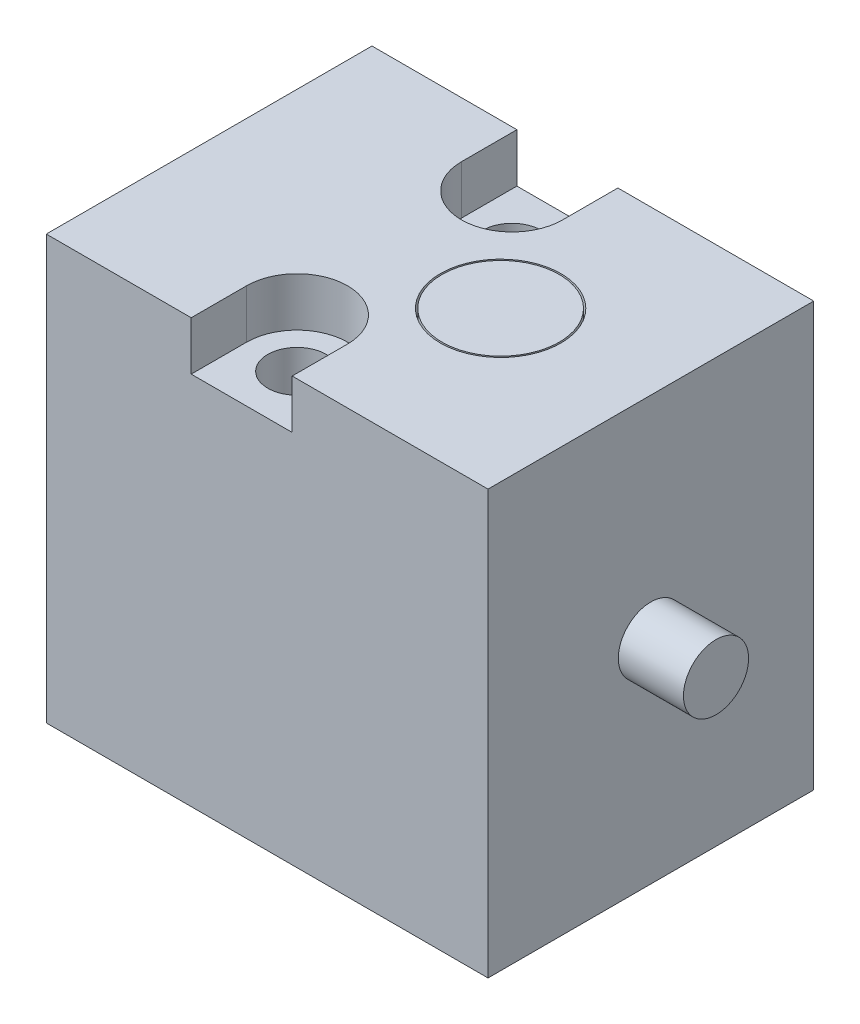
ISO-10303-21;
HEADER;
FILE_DESCRIPTION(('STEP AP214'),'2;1');
FILE_NAME('part.step','',(''),(''),'','','');
FILE_SCHEMA(('AUTOMOTIVE_DESIGN { 1 0 10303 214 1 1 1 1 }'));
ENDSEC;
DATA;
#1=APPLICATION_CONTEXT('core data for automotive mechanical design processes');
#2=APPLICATION_PROTOCOL_DEFINITION('international standard','automotive_design',2000,#1);
#3=PRODUCT_CONTEXT('',#1,'mechanical');
#4=PRODUCT('Part','Part','',(#3));
#5=PRODUCT_RELATED_PRODUCT_CATEGORY('part','',(#4));
#6=PRODUCT_DEFINITION_FORMATION('','',#4);
#7=PRODUCT_DEFINITION_CONTEXT('part definition',#1,'design');
#8=PRODUCT_DEFINITION('design','',#6,#7);
#9=PRODUCT_DEFINITION_SHAPE('','',#8);
#10=(LENGTH_UNIT() NAMED_UNIT(*) SI_UNIT(.MILLI.,.METRE.));
#11=(NAMED_UNIT(*) PLANE_ANGLE_UNIT() SI_UNIT($,.RADIAN.));
#12=(NAMED_UNIT(*) SI_UNIT($,.STERADIAN.) SOLID_ANGLE_UNIT());
#13=UNCERTAINTY_MEASURE_WITH_UNIT(LENGTH_MEASURE(1.E-05),#10,'distance_accuracy_value','');
#14=(GEOMETRIC_REPRESENTATION_CONTEXT(3) GLOBAL_UNCERTAINTY_ASSIGNED_CONTEXT((#13)) GLOBAL_UNIT_ASSIGNED_CONTEXT((#10,
#11,#12)) REPRESENTATION_CONTEXT('',''));
#15=CARTESIAN_POINT('',(0.,0.,0.));
#16=DIRECTION('',(0.,0.,1.));
#17=DIRECTION('',(1.,0.,0.));
#18=AXIS2_PLACEMENT_3D('',#15,#16,#17);
#19=CARTESIAN_POINT('',(6.7815,6.5,5.));
#20=DIRECTION('',(0.,0.,1.));
#21=DIRECTION('',(1.,0.,0.));
#22=AXIS2_PLACEMENT_3D('',#19,#20,#21);
#23=PLANE('',#22);
#24=DIRECTION('',(0.,-1.,0.));
#25=VECTOR('',#24,1.);
#26=CARTESIAN_POINT('',(4.45,6.5,5.));
#27=LINE('',#26,#25);
#28=CARTESIAN_POINT('',(4.45,13.,5.));
#29=VERTEX_POINT('',#28);
#30=CARTESIAN_POINT('',(4.45,11.5,5.));
#31=VERTEX_POINT('',#30);
#32=EDGE_CURVE('E130',#29,#31,#27,.T.);
#33=ORIENTED_EDGE('',*,*,#32,.F.);
#34=DIRECTION('',(1.,0.,0.));
#35=VECTOR('',#34,1.);
#36=CARTESIAN_POINT('',(6.7815,13.,5.));
#37=LINE('',#36,#35);
#38=CARTESIAN_POINT('',(0.,13.,5.));
#39=VERTEX_POINT('',#38);
#40=EDGE_CURVE('E206',#39,#29,#37,.T.);
#41=ORIENTED_EDGE('',*,*,#40,.F.);
#42=DIRECTION('',(0.,1.,0.));
#43=VECTOR('',#42,1.);
#44=CARTESIAN_POINT('',(0.,6.5,5.));
#45=LINE('',#44,#43);
#46=CARTESIAN_POINT('',(0.,0.,5.));
#47=VERTEX_POINT('',#46);
#48=EDGE_CURVE('E210',#47,#39,#45,.T.);
#49=ORIENTED_EDGE('',*,*,#48,.F.);
#50=DIRECTION('',(-1.,0.,0.));
#51=VECTOR('',#50,1.);
#52=CARTESIAN_POINT('',(6.7815,0.,5.));
#53=LINE('',#52,#51);
#54=CARTESIAN_POINT('',(13.563,0.,5.));
#55=VERTEX_POINT('',#54);
#56=EDGE_CURVE('E213',#55,#47,#53,.T.);
#57=ORIENTED_EDGE('',*,*,#56,.F.);
#58=DIRECTION('',(0.,-1.,0.));
#59=VECTOR('',#58,1.);
#60=CARTESIAN_POINT('',(13.563,6.5,5.));
#61=LINE('',#60,#59);
#62=CARTESIAN_POINT('',(13.563,13.,5.));
#63=VERTEX_POINT('',#62);
#64=EDGE_CURVE('E201',#63,#55,#61,.T.);
#65=ORIENTED_EDGE('',*,*,#64,.F.);
#66=CARTESIAN_POINT('',(7.55,13.,5.));
#67=VERTEX_POINT('',#66);
#68=EDGE_CURVE('E205',#67,#63,#37,.T.);
#69=ORIENTED_EDGE('',*,*,#68,.F.);
#70=DIRECTION('',(0.,1.,0.));
#71=VECTOR('',#70,1.);
#72=CARTESIAN_POINT('',(7.55,6.5,5.));
#73=LINE('',#72,#71);
#74=CARTESIAN_POINT('',(7.55,11.5,5.));
#75=VERTEX_POINT('',#74);
#76=EDGE_CURVE('E31',#75,#67,#73,.T.);
#77=ORIENTED_EDGE('',*,*,#76,.F.);
#78=DIRECTION('',(1.,0.,0.));
#79=VECTOR('',#78,1.);
#80=CARTESIAN_POINT('',(6.7815,11.5,5.));
#81=LINE('',#80,#79);
#82=EDGE_CURVE('E24',#31,#75,#81,.T.);
#83=ORIENTED_EDGE('',*,*,#82,.F.);
#84=EDGE_LOOP('',(#33,#41,#49,#57,#65,#69,#77,#83));
#85=FACE_BOUND('',#84,.T.);
#86=ADVANCED_FACE('F16',(#85),#23,.T.);
#87=CARTESIAN_POINT('',(6.7815,0.,-5.));
#88=DIRECTION('',(0.,-1.,0.));
#89=DIRECTION('',(0.,0.,-1.));
#90=AXIS2_PLACEMENT_3D('',#87,#88,#89);
#91=PLANE('',#90);
#92=CARTESIAN_POINT('',(9.4,0.,0.));
#93=DIRECTION('',(0.,-1.,0.));
#94=DIRECTION('',(0.,0.,-1.));
#95=AXIS2_PLACEMENT_3D('',#92,#93,#94);
#96=CIRCLE('',#95,0.6);
#97=CARTESIAN_POINT('',(9.4,0.,-0.6));
#98=VERTEX_POINT('',#97);
#99=EDGE_CURVE('E258',#98,#98,#96,.T.);
#100=ORIENTED_EDGE('',*,*,#99,.F.);
#101=EDGE_LOOP('',(#100));
#102=FACE_BOUND('',#101,.T.);
#103=CARTESIAN_POINT('',(4.,0.,0.));
#104=DIRECTION('',(0.,-1.,0.));
#105=DIRECTION('',(0.,0.,-1.));
#106=AXIS2_PLACEMENT_3D('',#103,#104,#105);
#107=CIRCLE('',#106,0.6);
#108=CARTESIAN_POINT('',(4.,0.,-0.6));
#109=VERTEX_POINT('',#108);
#110=EDGE_CURVE('E253',#109,#109,#107,.T.);
#111=ORIENTED_EDGE('',*,*,#110,.F.);
#112=EDGE_LOOP('',(#111));
#113=FACE_BOUND('',#112,.T.);
#114=CARTESIAN_POINT('',(6.,0.,3.3));
#115=DIRECTION('',(0.,-1.,0.));
#116=DIRECTION('',(0.,0.,-1.));
#117=AXIS2_PLACEMENT_3D('',#114,#115,#116);
#118=CIRCLE('',#117,0.9);
#119=CARTESIAN_POINT('',(6.,0.,2.4));
#120=VERTEX_POINT('',#119);
#121=EDGE_CURVE('E243',#120,#120,#118,.T.);
#122=ORIENTED_EDGE('',*,*,#121,.F.);
#123=EDGE_LOOP('',(#122));
#124=FACE_BOUND('',#123,.T.);
#125=CARTESIAN_POINT('',(6.,0.,-3.3));
#126=DIRECTION('',(0.,-1.,0.));
#127=DIRECTION('',(0.,0.,-1.));
#128=AXIS2_PLACEMENT_3D('',#125,#126,#127);
#129=CIRCLE('',#128,0.9);
#130=CARTESIAN_POINT('',(6.,0.,-4.2));
#131=VERTEX_POINT('',#130);
#132=EDGE_CURVE('E242',#131,#131,#129,.T.);
#133=ORIENTED_EDGE('',*,*,#132,.F.);
#134=EDGE_LOOP('',(#133));
#135=FACE_BOUND('',#134,.T.);
#136=DIRECTION('',(0.,0.,1.));
#137=VECTOR('',#136,1.);
#138=CARTESIAN_POINT('',(13.563,0.,-5.));
#139=LINE('',#138,#137);
#140=CARTESIAN_POINT('',(13.563,0.,-5.));
#141=VERTEX_POINT('',#140);
#142=EDGE_CURVE('E177',#141,#55,#139,.T.);
#143=ORIENTED_EDGE('',*,*,#142,.T.);
#144=ORIENTED_EDGE('',*,*,#56,.T.);
#145=DIRECTION('',(0.,0.,1.));
#146=VECTOR('',#145,1.);
#147=CARTESIAN_POINT('',(0.,0.,-5.));
#148=LINE('',#147,#146);
#149=CARTESIAN_POINT('',(0.,0.,-5.));
#150=VERTEX_POINT('',#149);
#151=EDGE_CURVE('E197',#150,#47,#148,.T.);
#152=ORIENTED_EDGE('',*,*,#151,.F.);
#153=DIRECTION('',(1.,0.,0.));
#154=VECTOR('',#153,1.);
#155=CARTESIAN_POINT('',(6.7815,0.,-5.));
#156=LINE('',#155,#154);
#157=EDGE_CURVE('E168',#150,#141,#156,.T.);
#158=ORIENTED_EDGE('',*,*,#157,.T.);
#159=EDGE_LOOP('',(#143,#144,#152,#158));
#160=FACE_BOUND('',#159,.T.);
#161=ADVANCED_FACE('F319',(#102,#113,#124,#135,#160),#91,.T.);
#162=CARTESIAN_POINT('',(0.,6.5,-5.));
#163=DIRECTION('',(-1.,0.,0.));
#164=DIRECTION('',(0.,0.,1.));
#165=AXIS2_PLACEMENT_3D('',#162,#163,#164);
#166=PLANE('',#165);
#167=CARTESIAN_POINT('',(0.,6.5,0.));
#168=DIRECTION('',(-1.,0.,0.));
#169=DIRECTION('',(0.,0.,1.));
#170=AXIS2_PLACEMENT_3D('',#167,#168,#169);
#171=CIRCLE('',#170,3.4);
#172=CARTESIAN_POINT('',(0.,6.5,3.4));
#173=VERTEX_POINT('',#172);
#174=EDGE_CURVE('E248',#173,#173,#171,.T.);
#175=ORIENTED_EDGE('',*,*,#174,.F.);
#176=EDGE_LOOP('',(#175));
#177=FACE_BOUND('',#176,.T.);
#178=ORIENTED_EDGE('',*,*,#151,.T.);
#179=ORIENTED_EDGE('',*,*,#48,.T.);
#180=DIRECTION('',(0.,0.,1.));
#181=VECTOR('',#180,1.);
#182=CARTESIAN_POINT('',(0.,13.,-5.));
#183=LINE('',#182,#181);
#184=CARTESIAN_POINT('',(0.,13.,-5.));
#185=VERTEX_POINT('',#184);
#186=EDGE_CURVE('E193',#185,#39,#183,.T.);
#187=ORIENTED_EDGE('',*,*,#186,.F.);
#188=DIRECTION('',(0.,-1.,0.));
#189=VECTOR('',#188,1.);
#190=CARTESIAN_POINT('',(0.,6.5,-5.));
#191=LINE('',#190,#189);
#192=EDGE_CURVE('E172',#185,#150,#191,.T.);
#193=ORIENTED_EDGE('',*,*,#192,.T.);
#194=EDGE_LOOP('',(#178,#179,#187,#193));
#195=FACE_BOUND('',#194,.T.);
#196=ADVANCED_FACE('F323',(#177,#195),#166,.T.);
#197=CARTESIAN_POINT('',(6.7815,13.,-5.));
#198=DIRECTION('',(0.,1.,0.));
#199=DIRECTION('',(0.,0.,1.));
#200=AXIS2_PLACEMENT_3D('',#197,#198,#199);
#201=PLANE('',#200);
#202=CARTESIAN_POINT('',(8.95,13.,0.));
#203=DIRECTION('',(0.,1.,0.));
#204=DIRECTION('',(0.,0.,1.));
#205=AXIS2_PLACEMENT_3D('',#202,#203,#204);
#206=CIRCLE('',#205,1.85);
#207=CARTESIAN_POINT('',(8.95,13.,1.85));
#208=VERTEX_POINT('',#207);
#209=EDGE_CURVE('E262',#208,#208,#206,.T.);
#210=ORIENTED_EDGE('',*,*,#209,.F.);
#211=EDGE_LOOP('',(#210));
#212=FACE_BOUND('',#211,.T.);
#213=DIRECTION('',(0.,0.,1.));
#214=VECTOR('',#213,1.);
#215=CARTESIAN_POINT('',(4.45,13.,-5.));
#216=LINE('',#215,#214);
#217=CARTESIAN_POINT('',(4.45,13.,3.3));
#218=VERTEX_POINT('',#217);
#219=EDGE_CURVE('E233',#218,#29,#216,.T.);
#220=ORIENTED_EDGE('',*,*,#219,.F.);
#221=CARTESIAN_POINT('',(6.,13.,3.3));
#222=DIRECTION('',(0.,1.,0.));
#223=DIRECTION('',(0.,0.,1.));
#224=AXIS2_PLACEMENT_3D('',#221,#222,#223);
#225=CIRCLE('',#224,1.55);
#226=CARTESIAN_POINT('',(7.55,13.,3.3));
#227=VERTEX_POINT('',#226);
#228=EDGE_CURVE('E114',#227,#218,#225,.T.);
#229=ORIENTED_EDGE('',*,*,#228,.F.);
#230=DIRECTION('',(0.,0.,-1.));
#231=VECTOR('',#230,1.);
#232=CARTESIAN_POINT('',(7.55,13.,-5.));
#233=LINE('',#232,#231);
#234=EDGE_CURVE('E228',#67,#227,#233,.T.);
#235=ORIENTED_EDGE('',*,*,#234,.F.);
#236=ORIENTED_EDGE('',*,*,#68,.T.);
#237=DIRECTION('',(0.,0.,1.));
#238=VECTOR('',#237,1.);
#239=CARTESIAN_POINT('',(13.563,13.,-5.));
#240=LINE('',#239,#238);
#241=CARTESIAN_POINT('',(13.563,13.,-5.));
#242=VERTEX_POINT('',#241);
#243=EDGE_CURVE('E189',#242,#63,#240,.T.);
#244=ORIENTED_EDGE('',*,*,#243,.F.);
#245=DIRECTION('',(-1.,0.,0.));
#246=VECTOR('',#245,1.);
#247=CARTESIAN_POINT('',(6.7815,13.,-5.));
#248=LINE('',#247,#246);
#249=CARTESIAN_POINT('',(7.55,13.,-5.));
#250=VERTEX_POINT('',#249);
#251=EDGE_CURVE('E178',#242,#250,#248,.T.);
#252=ORIENTED_EDGE('',*,*,#251,.T.);
#253=DIRECTION('',(0.,0.,-1.));
#254=VECTOR('',#253,1.);
#255=CARTESIAN_POINT('',(7.55,13.,-5.));
#256=LINE('',#255,#254);
#257=CARTESIAN_POINT('',(7.55,13.,-3.3));
#258=VERTEX_POINT('',#257);
#259=EDGE_CURVE('E39',#258,#250,#256,.T.);
#260=ORIENTED_EDGE('',*,*,#259,.F.);
#261=CARTESIAN_POINT('',(6.,13.,-3.3));
#262=DIRECTION('',(0.,1.,0.));
#263=DIRECTION('',(0.,0.,1.));
#264=AXIS2_PLACEMENT_3D('',#261,#262,#263);
#265=CIRCLE('',#264,1.55);
#266=CARTESIAN_POINT('',(4.45,13.,-3.3));
#267=VERTEX_POINT('',#266);
#268=EDGE_CURVE('E225',#267,#258,#265,.T.);
#269=ORIENTED_EDGE('',*,*,#268,.F.);
#270=DIRECTION('',(0.,0.,1.));
#271=VECTOR('',#270,1.);
#272=CARTESIAN_POINT('',(4.45,13.,-5.));
#273=LINE('',#272,#271);
#274=CARTESIAN_POINT('',(4.45,13.,-5.));
#275=VERTEX_POINT('',#274);
#276=EDGE_CURVE('E165',#275,#267,#273,.T.);
#277=ORIENTED_EDGE('',*,*,#276,.F.);
#278=EDGE_CURVE('E182',#275,#185,#248,.T.);
#279=ORIENTED_EDGE('',*,*,#278,.T.);
#280=ORIENTED_EDGE('',*,*,#186,.T.);
#281=ORIENTED_EDGE('',*,*,#40,.T.);
#282=EDGE_LOOP('',(#220,#229,#235,#236,#244,#252,#260,#269,#277,#279,#280,#281));
#283=FACE_BOUND('',#282,.T.);
#284=ADVANCED_FACE('F300',(#212,#283),#201,.T.);
#285=CARTESIAN_POINT('',(6.7815,6.5,-5.));
#286=DIRECTION('',(0.,0.,-1.));
#287=DIRECTION('',(-1.,0.,0.));
#288=AXIS2_PLACEMENT_3D('',#285,#286,#287);
#289=PLANE('',#288);
#290=DIRECTION('',(0.,1.,0.));
#291=VECTOR('',#290,1.);
#292=CARTESIAN_POINT('',(4.45,6.5,-5.));
#293=LINE('',#292,#291);
#294=CARTESIAN_POINT('',(4.45,11.5,-5.));
#295=VERTEX_POINT('',#294);
#296=EDGE_CURVE('E222',#295,#275,#293,.T.);
#297=ORIENTED_EDGE('',*,*,#296,.F.);
#298=DIRECTION('',(-1.,0.,0.));
#299=VECTOR('',#298,1.);
#300=CARTESIAN_POINT('',(6.7815,11.5,-5.));
#301=LINE('',#300,#299);
#302=CARTESIAN_POINT('',(7.55,11.5,-5.));
#303=VERTEX_POINT('',#302);
#304=EDGE_CURVE('E219',#303,#295,#301,.T.);
#305=ORIENTED_EDGE('',*,*,#304,.F.);
#306=DIRECTION('',(0.,-1.,0.));
#307=VECTOR('',#306,1.);
#308=CARTESIAN_POINT('',(7.55,6.5,-5.));
#309=LINE('',#308,#307);
#310=EDGE_CURVE('E216',#250,#303,#309,.T.);
#311=ORIENTED_EDGE('',*,*,#310,.F.);
#312=ORIENTED_EDGE('',*,*,#251,.F.);
#313=DIRECTION('',(0.,1.,0.));
#314=VECTOR('',#313,1.);
#315=CARTESIAN_POINT('',(13.563,6.5,-5.));
#316=LINE('',#315,#314);
#317=EDGE_CURVE('E173',#141,#242,#316,.T.);
#318=ORIENTED_EDGE('',*,*,#317,.F.);
#319=ORIENTED_EDGE('',*,*,#157,.F.);
#320=ORIENTED_EDGE('',*,*,#192,.F.);
#321=ORIENTED_EDGE('',*,*,#278,.F.);
#322=EDGE_LOOP('',(#297,#305,#311,#312,#318,#319,#320,#321));
#323=FACE_BOUND('',#322,.T.);
#324=ADVANCED_FACE('F335',(#323),#289,.T.);
#325=CARTESIAN_POINT('',(13.563,6.5,-5.));
#326=DIRECTION('',(1.,0.,0.));
#327=DIRECTION('',(0.,0.,-1.));
#328=AXIS2_PLACEMENT_3D('',#325,#326,#327);
#329=PLANE('',#328);
#330=CARTESIAN_POINT('',(13.563,6.5,0.));
#331=DIRECTION('',(1.,0.,0.));
#332=DIRECTION('',(0.,0.,-1.));
#333=AXIS2_PLACEMENT_3D('',#330,#331,#332);
#334=CIRCLE('',#333,1.);
#335=CARTESIAN_POINT('',(13.563,6.5,-1.));
#336=VERTEX_POINT('',#335);
#337=EDGE_CURVE('E11',#336,#336,#334,.T.);
#338=ORIENTED_EDGE('',*,*,#337,.F.);
#339=EDGE_LOOP('',(#338));
#340=FACE_BOUND('',#339,.T.);
#341=ORIENTED_EDGE('',*,*,#317,.T.);
#342=ORIENTED_EDGE('',*,*,#243,.T.);
#343=ORIENTED_EDGE('',*,*,#64,.T.);
#344=ORIENTED_EDGE('',*,*,#142,.F.);
#345=EDGE_LOOP('',(#341,#342,#343,#344));
#346=FACE_BOUND('',#345,.T.);
#347=ADVANCED_FACE('F337',(#340,#346),#329,.T.);
#348=CARTESIAN_POINT('',(6.,11.5,-3.3));
#349=DIRECTION('',(0.,-1.,0.));
#350=DIRECTION('',(0.,0.,-1.));
#351=AXIS2_PLACEMENT_3D('',#348,#349,#350);
#352=PLANE('',#351);
#353=CARTESIAN_POINT('',(6.,11.5,-3.3));
#354=DIRECTION('',(0.,-1.,0.));
#355=DIRECTION('',(0.,0.,-1.));
#356=AXIS2_PLACEMENT_3D('',#353,#354,#355);
#357=CIRCLE('',#356,0.9);
#358=CARTESIAN_POINT('',(6.,11.5,-4.2));
#359=VERTEX_POINT('',#358);
#360=EDGE_CURVE('E238',#359,#359,#357,.T.);
#361=ORIENTED_EDGE('',*,*,#360,.T.);
#362=EDGE_LOOP('',(#361));
#363=FACE_BOUND('',#362,.T.);
#364=ORIENTED_EDGE('',*,*,#304,.T.);
#365=DIRECTION('',(0.,0.,-1.));
#366=VECTOR('',#365,1.);
#367=CARTESIAN_POINT('',(4.45,11.5,-3.3));
#368=LINE('',#367,#366);
#369=CARTESIAN_POINT('',(4.45,11.5,-3.3));
#370=VERTEX_POINT('',#369);
#371=EDGE_CURVE('E152',#370,#295,#368,.T.);
#372=ORIENTED_EDGE('',*,*,#371,.F.);
#373=CARTESIAN_POINT('',(6.,11.5,-3.3));
#374=DIRECTION('',(0.,1.,0.));
#375=DIRECTION('',(-1.,0.,0.));
#376=AXIS2_PLACEMENT_3D('',#373,#374,#375);
#377=CIRCLE('',#376,1.55);
#378=CARTESIAN_POINT('',(7.55,11.5,-3.3));
#379=VERTEX_POINT('',#378);
#380=EDGE_CURVE('E156',#370,#379,#377,.T.);
#381=ORIENTED_EDGE('',*,*,#380,.T.);
#382=DIRECTION('',(0.,0.,-1.));
#383=VECTOR('',#382,1.);
#384=CARTESIAN_POINT('',(7.55,11.5,-3.3));
#385=LINE('',#384,#383);
#386=EDGE_CURVE('E148',#379,#303,#385,.T.);
#387=ORIENTED_EDGE('',*,*,#386,.T.);
#388=EDGE_LOOP('',(#364,#372,#381,#387));
#389=FACE_BOUND('',#388,.T.);
#390=ADVANCED_FACE('F340',(#363,#389),#352,.F.);
#391=CARTESIAN_POINT('',(6.,14.,-3.3));
#392=DIRECTION('',(0.,-1.,0.));
#393=DIRECTION('',(-1.,0.,0.));
#394=AXIS2_PLACEMENT_3D('',#391,#392,#393);
#395=CYLINDRICAL_SURFACE('',#394,1.55);
#396=ORIENTED_EDGE('',*,*,#268,.T.);
#397=DIRECTION('',(0.,-1.,0.));
#398=VECTOR('',#397,1.);
#399=CARTESIAN_POINT('',(7.55,14.,-3.3));
#400=LINE('',#399,#398);
#401=EDGE_CURVE('E160',#379,#258,#400,.F.);
#402=ORIENTED_EDGE('',*,*,#401,.F.);
#403=ORIENTED_EDGE('',*,*,#380,.F.);
#404=DIRECTION('',(0.,1.,0.));
#405=VECTOR('',#404,1.);
#406=CARTESIAN_POINT('',(4.45,14.,-3.3));
#407=LINE('',#406,#405);
#408=EDGE_CURVE('E144',#370,#267,#407,.T.);
#409=ORIENTED_EDGE('',*,*,#408,.T.);
#410=EDGE_LOOP('',(#396,#402,#403,#409));
#411=FACE_BOUND('',#410,.T.);
#412=ADVANCED_FACE('F345',(#411),#395,.F.);
#413=CARTESIAN_POINT('',(4.45,14.,-3.3));
#414=DIRECTION('',(-1.,0.,0.));
#415=DIRECTION('',(0.,0.,1.));
#416=AXIS2_PLACEMENT_3D('',#413,#414,#415);
#417=PLANE('',#416);
#418=ORIENTED_EDGE('',*,*,#276,.T.);
#419=ORIENTED_EDGE('',*,*,#408,.F.);
#420=ORIENTED_EDGE('',*,*,#371,.T.);
#421=ORIENTED_EDGE('',*,*,#296,.T.);
#422=EDGE_LOOP('',(#418,#419,#420,#421));
#423=FACE_BOUND('',#422,.T.);
#424=ADVANCED_FACE('F348',(#423),#417,.F.);
#425=CARTESIAN_POINT('',(7.55,14.,-3.3));
#426=DIRECTION('',(1.,0.,0.));
#427=DIRECTION('',(0.,0.,-1.));
#428=AXIS2_PLACEMENT_3D('',#425,#426,#427);
#429=PLANE('',#428);
#430=ORIENTED_EDGE('',*,*,#259,.T.);
#431=ORIENTED_EDGE('',*,*,#310,.T.);
#432=ORIENTED_EDGE('',*,*,#386,.F.);
#433=ORIENTED_EDGE('',*,*,#401,.T.);
#434=EDGE_LOOP('',(#430,#431,#432,#433));
#435=FACE_BOUND('',#434,.T.);
#436=ADVANCED_FACE('F355',(#435),#429,.F.);
#437=CARTESIAN_POINT('',(6.,11.5,3.3));
#438=DIRECTION('',(0.,-1.,0.));
#439=DIRECTION('',(0.,0.,-1.));
#440=AXIS2_PLACEMENT_3D('',#437,#438,#439);
#441=PLANE('',#440);
#442=CARTESIAN_POINT('',(6.,11.5,3.3));
#443=DIRECTION('',(0.,-1.,0.));
#444=DIRECTION('',(0.,0.,-1.));
#445=AXIS2_PLACEMENT_3D('',#442,#443,#444);
#446=CIRCLE('',#445,0.9);
#447=CARTESIAN_POINT('',(6.,11.5,2.4));
#448=VERTEX_POINT('',#447);
#449=EDGE_CURVE('E244',#448,#448,#446,.T.);
#450=ORIENTED_EDGE('',*,*,#449,.T.);
#451=EDGE_LOOP('',(#450));
#452=FACE_BOUND('',#451,.T.);
#453=ORIENTED_EDGE('',*,*,#82,.T.);
#454=DIRECTION('',(0.,0.,1.));
#455=VECTOR('',#454,1.);
#456=CARTESIAN_POINT('',(7.55,11.5,3.3));
#457=LINE('',#456,#455);
#458=CARTESIAN_POINT('',(7.55,11.5,3.3));
#459=VERTEX_POINT('',#458);
#460=EDGE_CURVE('E125',#459,#75,#457,.T.);
#461=ORIENTED_EDGE('',*,*,#460,.F.);
#462=CARTESIAN_POINT('',(6.,11.5,3.3));
#463=DIRECTION('',(0.,1.,0.));
#464=DIRECTION('',(-1.,0.,0.));
#465=AXIS2_PLACEMENT_3D('',#462,#463,#464);
#466=CIRCLE('',#465,1.55);
#467=CARTESIAN_POINT('',(4.45,11.5,3.3));
#468=VERTEX_POINT('',#467);
#469=EDGE_CURVE('E111',#459,#468,#466,.T.);
#470=ORIENTED_EDGE('',*,*,#469,.T.);
#471=DIRECTION('',(0.,0.,1.));
#472=VECTOR('',#471,1.);
#473=CARTESIAN_POINT('',(4.45,11.5,3.3));
#474=LINE('',#473,#472);
#475=EDGE_CURVE('E123',#468,#31,#474,.T.);
#476=ORIENTED_EDGE('',*,*,#475,.T.);
#477=EDGE_LOOP('',(#453,#461,#470,#476));
#478=FACE_BOUND('',#477,.T.);
#479=ADVANCED_FACE('F122',(#452,#478),#441,.F.);
#480=CARTESIAN_POINT('',(6.,14.,3.3));
#481=DIRECTION('',(0.,-1.,0.));
#482=DIRECTION('',(-1.,0.,0.));
#483=AXIS2_PLACEMENT_3D('',#480,#481,#482);
#484=CYLINDRICAL_SURFACE('',#483,1.55);
#485=ORIENTED_EDGE('',*,*,#228,.T.);
#486=DIRECTION('',(0.,-1.,0.));
#487=VECTOR('',#486,1.);
#488=CARTESIAN_POINT('',(4.45,14.,3.3));
#489=LINE('',#488,#487);
#490=EDGE_CURVE('E107',#218,#468,#489,.T.);
#491=ORIENTED_EDGE('',*,*,#490,.T.);
#492=ORIENTED_EDGE('',*,*,#469,.F.);
#493=DIRECTION('',(0.,1.,0.));
#494=VECTOR('',#493,1.);
#495=CARTESIAN_POINT('',(7.55,14.,3.3));
#496=LINE('',#495,#494);
#497=EDGE_CURVE('E136',#459,#227,#496,.T.);
#498=ORIENTED_EDGE('',*,*,#497,.T.);
#499=EDGE_LOOP('',(#485,#491,#492,#498));
#500=FACE_BOUND('',#499,.T.);
#501=ADVANCED_FACE('F109',(#500),#484,.F.);
#502=CARTESIAN_POINT('',(4.45,14.,3.3));
#503=DIRECTION('',(-1.,0.,0.));
#504=DIRECTION('',(0.,0.,1.));
#505=AXIS2_PLACEMENT_3D('',#502,#503,#504);
#506=PLANE('',#505);
#507=ORIENTED_EDGE('',*,*,#32,.T.);
#508=ORIENTED_EDGE('',*,*,#475,.F.);
#509=ORIENTED_EDGE('',*,*,#490,.F.);
#510=ORIENTED_EDGE('',*,*,#219,.T.);
#511=EDGE_LOOP('',(#507,#508,#509,#510));
#512=FACE_BOUND('',#511,.T.);
#513=ADVANCED_FACE('F128',(#512),#506,.F.);
#514=CARTESIAN_POINT('',(7.55,14.,3.3));
#515=DIRECTION('',(1.,0.,0.));
#516=DIRECTION('',(0.,0.,-1.));
#517=AXIS2_PLACEMENT_3D('',#514,#515,#516);
#518=PLANE('',#517);
#519=ORIENTED_EDGE('',*,*,#76,.T.);
#520=ORIENTED_EDGE('',*,*,#234,.T.);
#521=ORIENTED_EDGE('',*,*,#497,.F.);
#522=ORIENTED_EDGE('',*,*,#460,.T.);
#523=EDGE_LOOP('',(#519,#520,#521,#522));
#524=FACE_BOUND('',#523,.T.);
#525=ADVANCED_FACE('F305',(#524),#518,.F.);
#526=CARTESIAN_POINT('',(6.,-1.,-3.3));
#527=DIRECTION('',(0.,1.,0.));
#528=DIRECTION('',(1.,0.,0.));
#529=AXIS2_PLACEMENT_3D('',#526,#527,#528);
#530=CYLINDRICAL_SURFACE('',#529,0.9);
#531=ORIENTED_EDGE('',*,*,#132,.T.);
#532=EDGE_LOOP('',(#531));
#533=FACE_BOUND('',#532,.T.);
#534=ORIENTED_EDGE('',*,*,#360,.F.);
#535=EDGE_LOOP('',(#534));
#536=FACE_BOUND('',#535,.T.);
#537=ADVANCED_FACE('F307',(#533,#536),#530,.F.);
#538=CARTESIAN_POINT('',(6.,-1.,3.3));
#539=DIRECTION('',(0.,1.,0.));
#540=DIRECTION('',(1.,0.,0.));
#541=AXIS2_PLACEMENT_3D('',#538,#539,#540);
#542=CYLINDRICAL_SURFACE('',#541,0.9);
#543=ORIENTED_EDGE('',*,*,#121,.T.);
#544=EDGE_LOOP('',(#543));
#545=FACE_BOUND('',#544,.T.);
#546=ORIENTED_EDGE('',*,*,#449,.F.);
#547=EDGE_LOOP('',(#546));
#548=FACE_BOUND('',#547,.T.);
#549=ADVANCED_FACE('F314',(#545,#548),#542,.F.);
#550=CARTESIAN_POINT('',(0.25,6.5,0.));
#551=DIRECTION('',(1.,0.,0.));
#552=DIRECTION('',(0.,0.,-1.));
#553=AXIS2_PLACEMENT_3D('',#550,#551,#552);
#554=PLANE('',#553);
#555=CARTESIAN_POINT('',(0.25,6.5,0.));
#556=DIRECTION('',(-1.,0.,0.));
#557=DIRECTION('',(0.,-1.,0.));
#558=AXIS2_PLACEMENT_3D('',#555,#556,#557);
#559=CIRCLE('',#558,3.4);
#560=CARTESIAN_POINT('',(0.25,3.1,0.));
#561=VERTEX_POINT('',#560);
#562=EDGE_CURVE('E252',#561,#561,#559,.T.);
#563=ORIENTED_EDGE('',*,*,#562,.T.);
#564=EDGE_LOOP('',(#563));
#565=FACE_BOUND('',#564,.T.);
#566=ADVANCED_FACE('F368',(#565),#554,.F.);
#567=CARTESIAN_POINT('',(-1.,6.5,0.));
#568=DIRECTION('',(1.,0.,0.));
#569=DIRECTION('',(0.,-1.,0.));
#570=AXIS2_PLACEMENT_3D('',#567,#568,#569);
#571=CYLINDRICAL_SURFACE('',#570,3.4);
#572=ORIENTED_EDGE('',*,*,#174,.T.);
#573=EDGE_LOOP('',(#572));
#574=FACE_BOUND('',#573,.T.);
#575=ORIENTED_EDGE('',*,*,#562,.F.);
#576=EDGE_LOOP('',(#575));
#577=FACE_BOUND('',#576,.T.);
#578=ADVANCED_FACE('F374',(#574,#577),#571,.F.);
#579=CARTESIAN_POINT('',(4.,5.,0.));
#580=DIRECTION('',(0.,1.,0.));
#581=DIRECTION('',(0.,0.,1.));
#582=AXIS2_PLACEMENT_3D('',#579,#580,#581);
#583=PLANE('',#582);
#584=CARTESIAN_POINT('',(4.,5.,0.));
#585=DIRECTION('',(0.,-1.,0.));
#586=DIRECTION('',(1.,0.,0.));
#587=AXIS2_PLACEMENT_3D('',#584,#585,#586);
#588=CIRCLE('',#587,0.6);
#589=CARTESIAN_POINT('',(4.6,5.,0.));
#590=VERTEX_POINT('',#589);
#591=EDGE_CURVE('E257',#590,#590,#588,.T.);
#592=ORIENTED_EDGE('',*,*,#591,.T.);
#593=EDGE_LOOP('',(#592));
#594=FACE_BOUND('',#593,.T.);
#595=ADVANCED_FACE('F379',(#594),#583,.F.);
#596=CARTESIAN_POINT('',(4.,-1.,0.));
#597=DIRECTION('',(0.,1.,0.));
#598=DIRECTION('',(1.,0.,0.));
#599=AXIS2_PLACEMENT_3D('',#596,#597,#598);
#600=CYLINDRICAL_SURFACE('',#599,0.6);
#601=ORIENTED_EDGE('',*,*,#110,.T.);
#602=EDGE_LOOP('',(#601));
#603=FACE_BOUND('',#602,.T.);
#604=ORIENTED_EDGE('',*,*,#591,.F.);
#605=EDGE_LOOP('',(#604));
#606=FACE_BOUND('',#605,.T.);
#607=ADVANCED_FACE('F382',(#603,#606),#600,.F.);
#608=CARTESIAN_POINT('',(9.4,5.,0.));
#609=DIRECTION('',(0.,1.,0.));
#610=DIRECTION('',(0.,0.,1.));
#611=AXIS2_PLACEMENT_3D('',#608,#609,#610);
#612=PLANE('',#611);
#613=CARTESIAN_POINT('',(9.4,5.,0.));
#614=DIRECTION('',(0.,-1.,0.));
#615=DIRECTION('',(1.,0.,0.));
#616=AXIS2_PLACEMENT_3D('',#613,#614,#615);
#617=CIRCLE('',#616,0.6);
#618=CARTESIAN_POINT('',(10.,5.,0.));
#619=VERTEX_POINT('',#618);
#620=EDGE_CURVE('E261',#619,#619,#617,.T.);
#621=ORIENTED_EDGE('',*,*,#620,.T.);
#622=EDGE_LOOP('',(#621));
#623=FACE_BOUND('',#622,.T.);
#624=ADVANCED_FACE('F385',(#623),#612,.F.);
#625=CARTESIAN_POINT('',(9.4,-1.,0.));
#626=DIRECTION('',(0.,1.,0.));
#627=DIRECTION('',(1.,0.,0.));
#628=AXIS2_PLACEMENT_3D('',#625,#626,#627);
#629=CYLINDRICAL_SURFACE('',#628,0.6);
#630=ORIENTED_EDGE('',*,*,#99,.T.);
#631=EDGE_LOOP('',(#630));
#632=FACE_BOUND('',#631,.T.);
#633=ORIENTED_EDGE('',*,*,#620,.F.);
#634=EDGE_LOOP('',(#633));
#635=FACE_BOUND('',#634,.T.);
#636=ADVANCED_FACE('F390',(#632,#635),#629,.F.);
#637=CARTESIAN_POINT('',(8.95,12.5,0.));
#638=DIRECTION('',(0.,-1.,0.));
#639=DIRECTION('',(0.,0.,-1.));
#640=AXIS2_PLACEMENT_3D('',#637,#638,#639);
#641=PLANE('',#640);
#642=CARTESIAN_POINT('',(8.95,12.5,0.));
#643=DIRECTION('',(0.,1.,0.));
#644=DIRECTION('',(-1.,0.,0.));
#645=AXIS2_PLACEMENT_3D('',#642,#643,#644);
#646=CIRCLE('',#645,1.8);
#647=CARTESIAN_POINT('',(7.15,12.5,0.));
#648=VERTEX_POINT('',#647);
#649=EDGE_CURVE('E282',#648,#648,#646,.T.);
#650=ORIENTED_EDGE('',*,*,#649,.F.);
#651=EDGE_LOOP('',(#650));
#652=FACE_BOUND('',#651,.T.);
#653=CARTESIAN_POINT('',(8.95,12.5,0.));
#654=DIRECTION('',(0.,1.,0.));
#655=DIRECTION('',(-1.,0.,0.));
#656=AXIS2_PLACEMENT_3D('',#653,#654,#655);
#657=CIRCLE('',#656,1.85);
#658=CARTESIAN_POINT('',(7.1,12.5,0.));
#659=VERTEX_POINT('',#658);
#660=EDGE_CURVE('E265',#659,#659,#657,.T.);
#661=ORIENTED_EDGE('',*,*,#660,.T.);
#662=EDGE_LOOP('',(#661));
#663=FACE_BOUND('',#662,.T.);
#664=ADVANCED_FACE('F393',(#652,#663),#641,.F.);
#665=CARTESIAN_POINT('',(8.95,14.,0.));
#666=DIRECTION('',(0.,-1.,0.));
#667=DIRECTION('',(-1.,0.,0.));
#668=AXIS2_PLACEMENT_3D('',#665,#666,#667);
#669=CYLINDRICAL_SURFACE('',#668,1.85);
#670=ORIENTED_EDGE('',*,*,#209,.T.);
#671=EDGE_LOOP('',(#670));
#672=FACE_BOUND('',#671,.T.);
#673=ORIENTED_EDGE('',*,*,#660,.F.);
#674=EDGE_LOOP('',(#673));
#675=FACE_BOUND('',#674,.T.);
#676=ADVANCED_FACE('F398',(#672,#675),#669,.F.);
#677=CARTESIAN_POINT('',(15.563,6.5,0.));
#678=DIRECTION('',(1.,0.,0.));
#679=DIRECTION('',(0.,0.,-1.));
#680=AXIS2_PLACEMENT_3D('',#677,#678,#679);
#681=PLANE('',#680);
#682=CARTESIAN_POINT('',(15.563,6.5,0.));
#683=DIRECTION('',(-1.,0.,0.));
#684=DIRECTION('',(0.,-1.,0.));
#685=AXIS2_PLACEMENT_3D('',#682,#683,#684);
#686=CIRCLE('',#685,1.);
#687=CARTESIAN_POINT('',(15.563,5.5,0.));
#688=VERTEX_POINT('',#687);
#689=EDGE_CURVE('E274',#688,#688,#686,.T.);
#690=ORIENTED_EDGE('',*,*,#689,.F.);
#691=EDGE_LOOP('',(#690));
#692=FACE_BOUND('',#691,.T.);
#693=ADVANCED_FACE('F401',(#692),#681,.T.);
#694=CARTESIAN_POINT('',(11.563,6.5,0.));
#695=DIRECTION('',(1.,0.,0.));
#696=DIRECTION('',(0.,-1.,0.));
#697=AXIS2_PLACEMENT_3D('',#694,#695,#696);
#698=CYLINDRICAL_SURFACE('',#697,1.);
#699=ORIENTED_EDGE('',*,*,#337,.T.);
#700=EDGE_LOOP('',(#699));
#701=FACE_BOUND('',#700,.T.);
#702=ORIENTED_EDGE('',*,*,#689,.T.);
#703=EDGE_LOOP('',(#702));
#704=FACE_BOUND('',#703,.T.);
#705=ADVANCED_FACE('F405',(#701,#704),#698,.T.);
#706=CARTESIAN_POINT('',(8.95,13.,0.));
#707=DIRECTION('',(0.,1.,0.));
#708=DIRECTION('',(0.,0.,1.));
#709=AXIS2_PLACEMENT_3D('',#706,#707,#708);
#710=PLANE('',#709);
#711=CARTESIAN_POINT('',(8.95,13.,0.));
#712=DIRECTION('',(0.,-1.,0.));
#713=DIRECTION('',(-1.,0.,0.));
#714=AXIS2_PLACEMENT_3D('',#711,#712,#713);
#715=CIRCLE('',#714,1.8);
#716=CARTESIAN_POINT('',(7.15,13.,0.));
#717=VERTEX_POINT('',#716);
#718=EDGE_CURVE('E423',#717,#717,#715,.T.);
#719=ORIENTED_EDGE('',*,*,#718,.F.);
#720=EDGE_LOOP('',(#719));
#721=FACE_BOUND('',#720,.T.);
#722=ADVANCED_FACE('F408',(#721),#710,.T.);
#723=CARTESIAN_POINT('',(8.95,13.,0.));
#724=DIRECTION('',(0.,-1.,0.));
#725=DIRECTION('',(-1.,0.,0.));
#726=AXIS2_PLACEMENT_3D('',#723,#724,#725);
#727=CYLINDRICAL_SURFACE('',#726,1.8);
#728=ORIENTED_EDGE('',*,*,#649,.T.);
#729=EDGE_LOOP('',(#728));
#730=FACE_BOUND('',#729,.T.);
#731=ORIENTED_EDGE('',*,*,#718,.T.);
#732=EDGE_LOOP('',(#731));
#733=FACE_BOUND('',#732,.T.);
#734=ADVANCED_FACE('F413',(#730,#733),#727,.T.);
#735=CLOSED_SHELL('',(#86,#161,#196,#284,#324,#347,#390,#412,#424,#436,#479,#501,#513,#525,#537,
#549,#566,#578,#595,#607,#624,#636,#664,#676,#693,#705,#722,#734));
#736=MANIFOLD_SOLID_BREP('B1',#735);
#737=ADVANCED_BREP_SHAPE_REPRESENTATION('',(#18,#736),#14);
#738=SHAPE_DEFINITION_REPRESENTATION(#9,#737);
ENDSEC;
END-ISO-10303-21;
